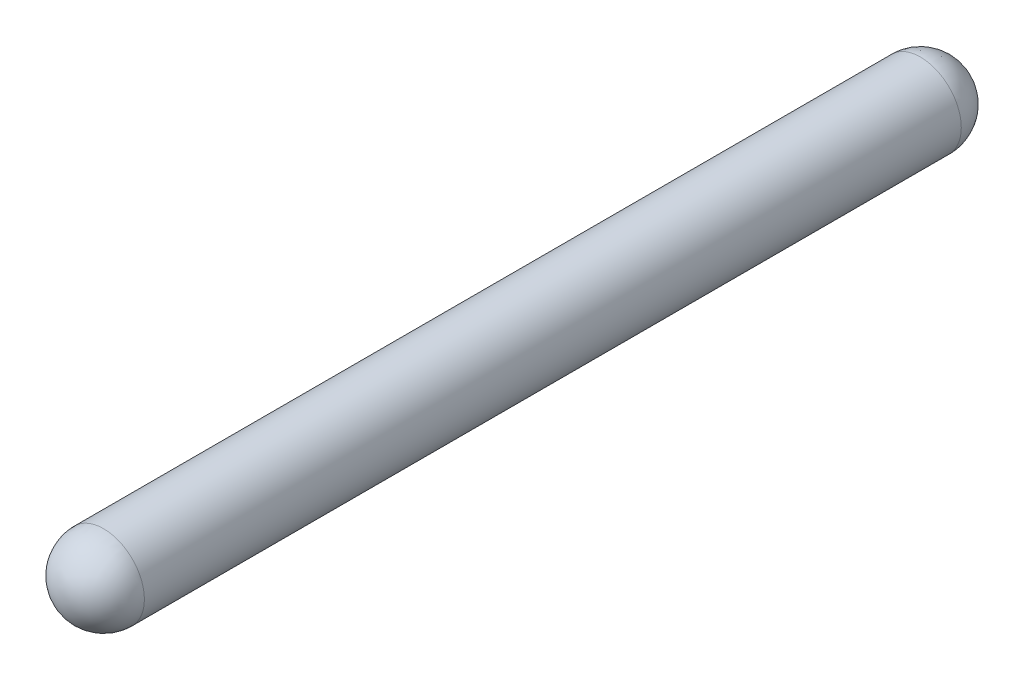
ISO-10303-21;
HEADER;
FILE_DESCRIPTION(('STEP AP214'),'2;1');
FILE_NAME('part.step','',(''),(''),'','','');
FILE_SCHEMA(('AUTOMOTIVE_DESIGN { 1 0 10303 214 1 1 1 1 }'));
ENDSEC;
DATA;
#1=APPLICATION_CONTEXT('core data for automotive mechanical design processes');
#2=APPLICATION_PROTOCOL_DEFINITION('international standard','automotive_design',2000,#1);
#3=PRODUCT_CONTEXT('',#1,'mechanical');
#4=PRODUCT('Part','Part','',(#3));
#5=PRODUCT_RELATED_PRODUCT_CATEGORY('part','',(#4));
#6=PRODUCT_DEFINITION_FORMATION('','',#4);
#7=PRODUCT_DEFINITION_CONTEXT('part definition',#1,'design');
#8=PRODUCT_DEFINITION('design','',#6,#7);
#9=PRODUCT_DEFINITION_SHAPE('','',#8);
#10=(LENGTH_UNIT() NAMED_UNIT(*) SI_UNIT(.MILLI.,.METRE.));
#11=(NAMED_UNIT(*) PLANE_ANGLE_UNIT() SI_UNIT($,.RADIAN.));
#12=(NAMED_UNIT(*) SI_UNIT($,.STERADIAN.) SOLID_ANGLE_UNIT());
#13=UNCERTAINTY_MEASURE_WITH_UNIT(LENGTH_MEASURE(1.E-05),#10,'distance_accuracy_value','');
#14=(GEOMETRIC_REPRESENTATION_CONTEXT(3) GLOBAL_UNCERTAINTY_ASSIGNED_CONTEXT((#13)) GLOBAL_UNIT_ASSIGNED_CONTEXT((#10,
#11,#12)) REPRESENTATION_CONTEXT('',''));
#15=CARTESIAN_POINT('',(0.,0.,0.));
#16=DIRECTION('',(0.,0.,1.));
#17=DIRECTION('',(1.,0.,0.));
#18=AXIS2_PLACEMENT_3D('',#15,#16,#17);
#19=CARTESIAN_POINT('',(0.,0.,-3.));
#20=DIRECTION('',(1.,0.,0.));
#21=DIRECTION('',(0.,-1.,0.));
#22=AXIS2_PLACEMENT_3D('',#19,#20,#21);
#23=SPHERICAL_SURFACE('',#22,0.25);
#24=CARTESIAN_POINT('',(0.,0.,-3.));
#25=DIRECTION('',(0.,0.,1.));
#26=DIRECTION('',(1.,0.,0.));
#27=AXIS2_PLACEMENT_3D('',#24,#25,#26);
#28=CIRCLE('',#27,0.25);
#29=CARTESIAN_POINT('',(0.25,0.,-3.));
#30=VERTEX_POINT('',#29);
#31=CARTESIAN_POINT('',(-0.25,0.,-3.));
#32=VERTEX_POINT('',#31);
#33=EDGE_CURVE('E42',#30,#32,#28,.T.);
#34=ORIENTED_EDGE('',*,*,#33,.F.);
#35=CARTESIAN_POINT('',(0.,0.,-3.));
#36=DIRECTION('',(0.,0.,1.));
#37=DIRECTION('',(1.,0.,0.));
#38=AXIS2_PLACEMENT_3D('',#35,#36,#37);
#39=CIRCLE('',#38,0.25);
#40=EDGE_CURVE('E26',#32,#30,#39,.T.);
#41=ORIENTED_EDGE('',*,*,#40,.F.);
#42=EDGE_LOOP('',(#34,#41));
#43=FACE_BOUND('',#42,.T.);
#44=ADVANCED_FACE('F17',(#43),#23,.T.);
#45=CARTESIAN_POINT('',(0.,0.,2.));
#46=DIRECTION('',(1.,0.,0.));
#47=DIRECTION('',(0.,1.,0.));
#48=AXIS2_PLACEMENT_3D('',#45,#46,#47);
#49=SPHERICAL_SURFACE('',#48,0.25);
#50=CARTESIAN_POINT('',(0.,0.,2.));
#51=DIRECTION('',(0.,0.,1.));
#52=DIRECTION('',(1.,0.,0.));
#53=AXIS2_PLACEMENT_3D('',#50,#51,#52);
#54=CIRCLE('',#53,0.25);
#55=CARTESIAN_POINT('',(0.25,0.,2.));
#56=VERTEX_POINT('',#55);
#57=CARTESIAN_POINT('',(-0.25,0.,2.));
#58=VERTEX_POINT('',#57);
#59=EDGE_CURVE('E11',#56,#58,#54,.F.);
#60=ORIENTED_EDGE('',*,*,#59,.F.);
#61=CARTESIAN_POINT('',(0.,0.,2.));
#62=DIRECTION('',(0.,0.,1.));
#63=DIRECTION('',(1.,0.,0.));
#64=AXIS2_PLACEMENT_3D('',#61,#62,#63);
#65=CIRCLE('',#64,0.25);
#66=EDGE_CURVE('E34',#58,#56,#65,.F.);
#67=ORIENTED_EDGE('',*,*,#66,.F.);
#68=EDGE_LOOP('',(#60,#67));
#69=FACE_BOUND('',#68,.T.);
#70=ADVANCED_FACE('F49',(#69),#49,.T.);
#71=CARTESIAN_POINT('',(0.,0.,-3.));
#72=DIRECTION('',(0.,0.,1.));
#73=DIRECTION('',(1.,0.,0.));
#74=AXIS2_PLACEMENT_3D('',#71,#72,#73);
#75=CYLINDRICAL_SURFACE('',#74,0.25);
#76=ORIENTED_EDGE('',*,*,#66,.T.);
#77=ORIENTED_EDGE('',*,*,#59,.T.);
#78=EDGE_LOOP('',(#76,#77));
#79=FACE_BOUND('',#78,.T.);
#80=ORIENTED_EDGE('',*,*,#40,.T.);
#81=ORIENTED_EDGE('',*,*,#33,.T.);
#82=EDGE_LOOP('',(#80,#81));
#83=FACE_BOUND('',#82,.T.);
#84=ADVANCED_FACE('F45',(#79,#83),#75,.T.);
#85=CLOSED_SHELL('',(#44,#70,#84));
#86=MANIFOLD_SOLID_BREP('B1',#85);
#87=ADVANCED_BREP_SHAPE_REPRESENTATION('',(#18,#86),#14);
#88=SHAPE_DEFINITION_REPRESENTATION(#9,#87);
ENDSEC;
END-ISO-10303-21;
